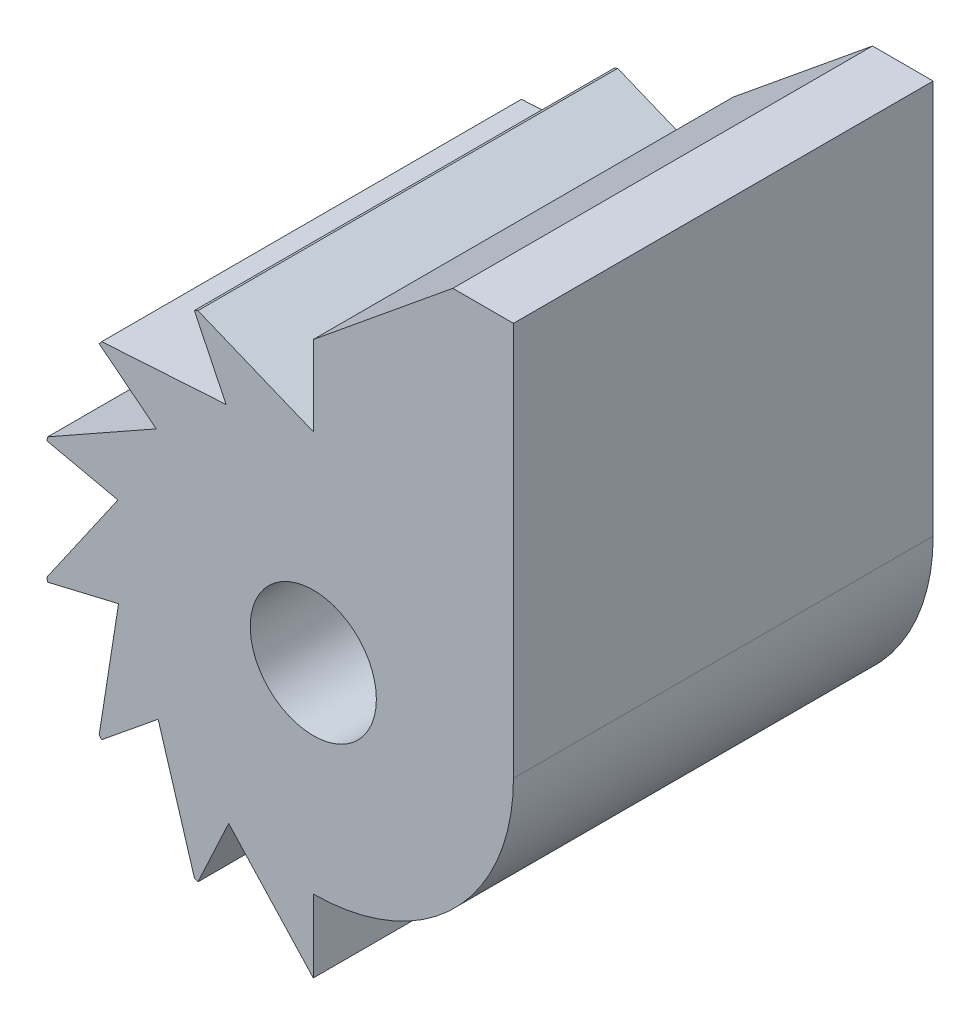
ISO-10303-21;
HEADER;
FILE_DESCRIPTION(('STEP AP214'),'2;1');
FILE_NAME('part.step','',(''),(''),'','','');
FILE_SCHEMA(('AUTOMOTIVE_DESIGN { 1 0 10303 214 1 1 1 1 }'));
ENDSEC;
DATA;
#1=APPLICATION_CONTEXT('core data for automotive mechanical design processes');
#2=APPLICATION_PROTOCOL_DEFINITION('international standard','automotive_design',2000,#1);
#3=PRODUCT_CONTEXT('',#1,'mechanical');
#4=PRODUCT('Part','Part','',(#3));
#5=PRODUCT_RELATED_PRODUCT_CATEGORY('part','',(#4));
#6=PRODUCT_DEFINITION_FORMATION('','',#4);
#7=PRODUCT_DEFINITION_CONTEXT('part definition',#1,'design');
#8=PRODUCT_DEFINITION('design','',#6,#7);
#9=PRODUCT_DEFINITION_SHAPE('','',#8);
#10=(LENGTH_UNIT() NAMED_UNIT(*) SI_UNIT(.MILLI.,.METRE.));
#11=(NAMED_UNIT(*) PLANE_ANGLE_UNIT() SI_UNIT($,.RADIAN.));
#12=(NAMED_UNIT(*) SI_UNIT($,.STERADIAN.) SOLID_ANGLE_UNIT());
#13=UNCERTAINTY_MEASURE_WITH_UNIT(LENGTH_MEASURE(1.E-05),#10,'distance_accuracy_value','');
#14=(GEOMETRIC_REPRESENTATION_CONTEXT(3) GLOBAL_UNCERTAINTY_ASSIGNED_CONTEXT((#13)) GLOBAL_UNIT_ASSIGNED_CONTEXT((#10,
#11,#12)) REPRESENTATION_CONTEXT('',''));
#15=CARTESIAN_POINT('',(0.,0.,0.));
#16=DIRECTION('',(0.,0.,1.));
#17=DIRECTION('',(1.,0.,0.));
#18=AXIS2_PLACEMENT_3D('',#15,#16,#17);
#19=CARTESIAN_POINT('',(0.,0.,21.971));
#20=DIRECTION('',(0.,0.,-1.));
#21=DIRECTION('',(-1.,0.,0.));
#22=AXIS2_PLACEMENT_3D('',#19,#20,#21);
#23=CYLINDRICAL_SURFACE('',#22,14.2875);
#24=DIRECTION('',(0.,0.,1.));
#25=VECTOR('',#24,1.);
#26=CARTESIAN_POINT('',(-6.2258468466904,12.8596845720086,0.));
#27=LINE('',#26,#25);
#28=CARTESIAN_POINT('',(-6.2258468466904,12.8596845720086,0.));
#29=VERTEX_POINT('',#28);
#30=CARTESIAN_POINT('',(-6.2258468466904,12.8596845720086,21.971));
#31=VERTEX_POINT('',#30);
#32=EDGE_CURVE('E269',#29,#31,#27,.T.);
#33=ORIENTED_EDGE('',*,*,#32,.T.);
#34=CARTESIAN_POINT('',(0.,0.,21.971));
#35=DIRECTION('',(0.,0.,1.));
#36=DIRECTION('',(1.,0.,0.));
#37=AXIS2_PLACEMENT_3D('',#34,#35,#36);
#38=CIRCLE('',#37,14.2875);
#39=CARTESIAN_POINT('',(-6.0381584146203,12.9488725072861,21.971));
#40=VERTEX_POINT('',#39);
#41=EDGE_CURVE('E233',#31,#40,#38,.F.);
#42=ORIENTED_EDGE('',*,*,#41,.T.);
#43=DIRECTION('',(0.,0.,1.));
#44=VECTOR('',#43,1.);
#45=CARTESIAN_POINT('',(-6.0381584146203,12.9488725072861,0.));
#46=LINE('',#45,#44);
#47=CARTESIAN_POINT('',(-6.0381584146203,12.9488725072861,0.));
#48=VERTEX_POINT('',#47);
#49=EDGE_CURVE('E216',#48,#40,#46,.T.);
#50=ORIENTED_EDGE('',*,*,#49,.F.);
#51=CARTESIAN_POINT('',(0.,0.,0.));
#52=DIRECTION('',(0.,0.,1.));
#53=DIRECTION('',(1.,0.,0.));
#54=AXIS2_PLACEMENT_3D('',#51,#52,#53);
#55=CIRCLE('',#54,14.2875);
#56=EDGE_CURVE('E292',#29,#48,#55,.F.);
#57=ORIENTED_EDGE('',*,*,#56,.F.);
#58=EDGE_LOOP('',(#33,#42,#50,#57));
#59=FACE_BOUND('',#58,.T.);
#60=ADVANCED_FACE('F39',(#59),#23,.T.);
#61=DIRECTION('',(0.,0.,1.));
#62=VECTOR('',#61,1.);
#63=CARTESIAN_POINT('',(-13.9023785884092,-3.29492425323272,0.));
#64=LINE('',#63,#62);
#65=CARTESIAN_POINT('',(-13.9023785884092,-3.29492425323272,0.));
#66=VERTEX_POINT('',#65);
#67=CARTESIAN_POINT('',(-13.9023785884092,-3.29492425323272,21.971));
#68=VERTEX_POINT('',#67);
#69=EDGE_CURVE('E464',#66,#68,#64,.T.);
#70=ORIENTED_EDGE('',*,*,#69,.T.);
#71=CARTESIAN_POINT('',(-13.948829201726,-3.09238098414067,21.971));
#72=VERTEX_POINT('',#71);
#73=EDGE_CURVE('E438',#68,#72,#38,.F.);
#74=ORIENTED_EDGE('',*,*,#73,.T.);
#75=DIRECTION('',(0.,0.,1.));
#76=VECTOR('',#75,1.);
#77=CARTESIAN_POINT('',(-13.948829201726,-3.09238098414067,0.));
#78=LINE('',#77,#76);
#79=CARTESIAN_POINT('',(-13.948829201726,-3.09238098414067,0.));
#80=VERTEX_POINT('',#79);
#81=EDGE_CURVE('E524',#80,#72,#78,.T.);
#82=ORIENTED_EDGE('',*,*,#81,.F.);
#83=EDGE_CURVE('E358',#66,#80,#55,.F.);
#84=ORIENTED_EDGE('',*,*,#83,.F.);
#85=EDGE_LOOP('',(#70,#74,#82,#84));
#86=FACE_BOUND('',#85,.T.);
#87=ADVANCED_FACE('F403',(#86),#23,.T.);
#88=DIRECTION('',(0.,0.,1.));
#89=VECTOR('',#88,1.);
#90=CARTESIAN_POINT('',(-11.2073388125384,-8.86161458149528,0.));
#91=LINE('',#90,#89);
#92=CARTESIAN_POINT('',(-11.2073388125384,-8.86161458149528,0.));
#93=VERTEX_POINT('',#92);
#94=CARTESIAN_POINT('',(-11.2073388125384,-8.86161458149528,21.971));
#95=VERTEX_POINT('',#94);
#96=EDGE_CURVE('E448',#93,#95,#91,.T.);
#97=ORIENTED_EDGE('',*,*,#96,.F.);
#98=CARTESIAN_POINT('',(-11.0772710184089,-9.02367569423451,0.));
#99=VERTEX_POINT('',#98);
#100=EDGE_CURVE('E356',#99,#93,#55,.F.);
#101=ORIENTED_EDGE('',*,*,#100,.F.);
#102=DIRECTION('',(0.,0.,1.));
#103=VECTOR('',#102,1.);
#104=CARTESIAN_POINT('',(-11.0772710184089,-9.02367569423451,0.));
#105=LINE('',#104,#103);
#106=CARTESIAN_POINT('',(-11.0772710184089,-9.02367569423451,21.971));
#107=VERTEX_POINT('',#106);
#108=EDGE_CURVE('E287',#99,#107,#105,.T.);
#109=ORIENTED_EDGE('',*,*,#108,.T.);
#110=EDGE_CURVE('E440',#107,#95,#38,.F.);
#111=ORIENTED_EDGE('',*,*,#110,.T.);
#112=EDGE_LOOP('',(#97,#101,#109,#111));
#113=FACE_BOUND('',#112,.T.);
#114=ADVANCED_FACE('F407',(#113),#23,.T.);
#115=DIRECTION('',(0.,0.,1.));
#116=VECTOR('',#115,1.);
#117=CARTESIAN_POINT('',(-13.9488292017261,3.09238098414053,0.));
#118=LINE('',#117,#116);
#119=CARTESIAN_POINT('',(-13.9488292017261,3.09238098414053,0.));
#120=VERTEX_POINT('',#119);
#121=CARTESIAN_POINT('',(-13.9488292017261,3.09238098414053,21.971));
#122=VERTEX_POINT('',#121);
#123=EDGE_CURVE('E425',#120,#122,#118,.T.);
#124=ORIENTED_EDGE('',*,*,#123,.T.);
#125=CARTESIAN_POINT('',(-13.9023785884092,3.29492425323258,21.971));
#126=VERTEX_POINT('',#125);
#127=EDGE_CURVE('E428',#122,#126,#38,.F.);
#128=ORIENTED_EDGE('',*,*,#127,.T.);
#129=DIRECTION('',(0.,0.,1.));
#130=VECTOR('',#129,1.);
#131=CARTESIAN_POINT('',(-13.9023785884092,3.29492425323258,0.));
#132=LINE('',#131,#130);
#133=CARTESIAN_POINT('',(-13.9023785884092,3.29492425323258,0.));
#134=VERTEX_POINT('',#133);
#135=EDGE_CURVE('E530',#134,#126,#132,.T.);
#136=ORIENTED_EDGE('',*,*,#135,.F.);
#137=EDGE_CURVE('E363',#120,#134,#55,.F.);
#138=ORIENTED_EDGE('',*,*,#137,.F.);
#139=EDGE_LOOP('',(#124,#128,#136,#138));
#140=FACE_BOUND('',#139,.T.);
#141=ADVANCED_FACE('F414',(#140),#23,.T.);
#142=DIRECTION('',(0.,0.,1.));
#143=VECTOR('',#142,1.);
#144=CARTESIAN_POINT('',(-11.077271018409,9.0236756942344,0.));
#145=LINE('',#144,#143);
#146=CARTESIAN_POINT('',(-11.077271018409,9.0236756942344,0.));
#147=VERTEX_POINT('',#146);
#148=CARTESIAN_POINT('',(-11.077271018409,9.0236756942344,21.971));
#149=VERTEX_POINT('',#148);
#150=EDGE_CURVE('E265',#147,#149,#145,.T.);
#151=ORIENTED_EDGE('',*,*,#150,.F.);
#152=CARTESIAN_POINT('',(-11.2073388125385,8.86161458149516,0.));
#153=VERTEX_POINT('',#152);
#154=EDGE_CURVE('E313',#153,#147,#55,.F.);
#155=ORIENTED_EDGE('',*,*,#154,.F.);
#156=DIRECTION('',(0.,0.,1.));
#157=VECTOR('',#156,1.);
#158=CARTESIAN_POINT('',(-11.2073388125385,8.86161458149516,0.));
#159=LINE('',#158,#157);
#160=CARTESIAN_POINT('',(-11.2073388125385,8.86161458149516,21.971));
#161=VERTEX_POINT('',#160);
#162=EDGE_CURVE('E380',#153,#161,#159,.T.);
#163=ORIENTED_EDGE('',*,*,#162,.T.);
#164=EDGE_CURVE('E296',#161,#149,#38,.F.);
#165=ORIENTED_EDGE('',*,*,#164,.T.);
#166=EDGE_LOOP('',(#151,#155,#163,#165));
#167=FACE_BOUND('',#166,.T.);
#168=ADVANCED_FACE('F378',(#167),#23,.T.);
#169=DIRECTION('',(0.,0.,1.));
#170=VECTOR('',#169,1.);
#171=CARTESIAN_POINT('',(-6.22584684669026,-12.8596845720086,0.));
#172=LINE('',#171,#170);
#173=CARTESIAN_POINT('',(-6.22584684669026,-12.8596845720086,0.));
#174=VERTEX_POINT('',#173);
#175=CARTESIAN_POINT('',(-6.22584684669026,-12.8596845720086,21.971));
#176=VERTEX_POINT('',#175);
#177=EDGE_CURVE('E354',#174,#176,#172,.T.);
#178=ORIENTED_EDGE('',*,*,#177,.F.);
#179=CARTESIAN_POINT('',(-6.03815841462016,-12.9488725072862,0.));
#180=VERTEX_POINT('',#179);
#181=EDGE_CURVE('E314',#180,#174,#55,.F.);
#182=ORIENTED_EDGE('',*,*,#181,.F.);
#183=DIRECTION('',(0.,0.,1.));
#184=VECTOR('',#183,1.);
#185=CARTESIAN_POINT('',(-6.03815841462016,-12.9488725072862,0.));
#186=LINE('',#185,#184);
#187=CARTESIAN_POINT('',(-6.03815841462016,-12.9488725072862,21.971));
#188=VERTEX_POINT('',#187);
#189=EDGE_CURVE('E289',#180,#188,#186,.T.);
#190=ORIENTED_EDGE('',*,*,#189,.T.);
#191=EDGE_CURVE('E297',#188,#176,#38,.F.);
#192=ORIENTED_EDGE('',*,*,#191,.T.);
#193=EDGE_LOOP('',(#178,#182,#190,#192));
#194=FACE_BOUND('',#193,.T.);
#195=ADVANCED_FACE('F41',(#194),#23,.T.);
#196=CARTESIAN_POINT('',(0.,0.,21.971));
#197=DIRECTION('',(1.,0.,0.));
#198=DIRECTION('',(0.,1.,0.));
#199=AXIS2_PLACEMENT_3D('',#196,#197,#198);
#200=PLANE('',#199);
#201=DIRECTION('',(0.,-1.,0.));
#202=VECTOR('',#201,1.);
#203=CARTESIAN_POINT('',(0.,0.,0.));
#204=LINE('',#203,#202);
#205=CARTESIAN_POINT('',(0.,-10.4775,0.));
#206=VERTEX_POINT('',#205);
#207=CARTESIAN_POINT('',(0.,-14.2875,0.));
#208=VERTEX_POINT('',#207);
#209=EDGE_CURVE('E315',#206,#208,#204,.T.);
#210=ORIENTED_EDGE('',*,*,#209,.F.);
#211=DIRECTION('',(0.,0.,-1.));
#212=VECTOR('',#211,1.);
#213=CARTESIAN_POINT('',(0.,-10.4775,21.971));
#214=LINE('',#213,#212);
#215=CARTESIAN_POINT('',(0.,-10.4775,21.971));
#216=VERTEX_POINT('',#215);
#217=EDGE_CURVE('E48',#216,#206,#214,.T.);
#218=ORIENTED_EDGE('',*,*,#217,.F.);
#219=DIRECTION('',(0.,-1.,0.));
#220=VECTOR('',#219,1.);
#221=CARTESIAN_POINT('',(0.,0.,21.971));
#222=LINE('',#221,#220);
#223=CARTESIAN_POINT('',(0.,-14.2875,21.971));
#224=VERTEX_POINT('',#223);
#225=EDGE_CURVE('E298',#216,#224,#222,.T.);
#226=ORIENTED_EDGE('',*,*,#225,.T.);
#227=DIRECTION('',(0.,0.,-1.));
#228=VECTOR('',#227,1.);
#229=CARTESIAN_POINT('',(0.,-14.2875,21.971));
#230=LINE('',#229,#228);
#231=EDGE_CURVE('E11',#224,#208,#230,.T.);
#232=ORIENTED_EDGE('',*,*,#231,.T.);
#233=EDGE_LOOP('',(#210,#218,#226,#232));
#234=FACE_BOUND('',#233,.T.);
#235=ADVANCED_FACE('F340',(#234),#200,.T.);
#236=CARTESIAN_POINT('',(0.,0.,21.971));
#237=DIRECTION('',(0.,0.,-1.));
#238=DIRECTION('',(-1.,0.,0.));
#239=AXIS2_PLACEMENT_3D('',#236,#237,#238);
#240=CYLINDRICAL_SURFACE('',#239,10.4775);
#241=CARTESIAN_POINT('',(0.,0.,0.));
#242=DIRECTION('',(0.,0.,1.));
#243=DIRECTION('',(1.,0.,0.));
#244=AXIS2_PLACEMENT_3D('',#241,#242,#243);
#245=CIRCLE('',#244,10.4775);
#246=CARTESIAN_POINT('',(10.4775,0.,0.));
#247=VERTEX_POINT('',#246);
#248=EDGE_CURVE('E318',#206,#247,#245,.T.);
#249=ORIENTED_EDGE('',*,*,#248,.T.);
#250=DIRECTION('',(0.,0.,-1.));
#251=VECTOR('',#250,1.);
#252=CARTESIAN_POINT('',(10.4775,0.,21.971));
#253=LINE('',#252,#251);
#254=CARTESIAN_POINT('',(10.4775,0.,21.971));
#255=VERTEX_POINT('',#254);
#256=EDGE_CURVE('E243',#255,#247,#253,.T.);
#257=ORIENTED_EDGE('',*,*,#256,.F.);
#258=CARTESIAN_POINT('',(0.,0.,21.971));
#259=DIRECTION('',(0.,0.,1.));
#260=DIRECTION('',(1.,0.,0.));
#261=AXIS2_PLACEMENT_3D('',#258,#259,#260);
#262=CIRCLE('',#261,10.4775);
#263=EDGE_CURVE('E301',#216,#255,#262,.T.);
#264=ORIENTED_EDGE('',*,*,#263,.F.);
#265=ORIENTED_EDGE('',*,*,#217,.T.);
#266=EDGE_LOOP('',(#249,#257,#264,#265));
#267=FACE_BOUND('',#266,.T.);
#268=ADVANCED_FACE('F337',(#267),#240,.T.);
#269=CARTESIAN_POINT('',(10.4775,0.,21.971));
#270=DIRECTION('',(-1.,0.,0.));
#271=DIRECTION('',(0.,0.,1.));
#272=AXIS2_PLACEMENT_3D('',#269,#270,#271);
#273=PLANE('',#272);
#274=DIRECTION('',(0.,1.,0.));
#275=VECTOR('',#274,1.);
#276=CARTESIAN_POINT('',(10.4775,0.,0.));
#277=LINE('',#276,#275);
#278=CARTESIAN_POINT('',(10.4775,20.6299721885842,0.));
#279=VERTEX_POINT('',#278);
#280=EDGE_CURVE('E235',#247,#279,#277,.T.);
#281=ORIENTED_EDGE('',*,*,#280,.T.);
#282=DIRECTION('',(0.,0.,-1.));
#283=VECTOR('',#282,1.);
#284=CARTESIAN_POINT('',(10.4775,20.6299721885842,21.971));
#285=LINE('',#284,#283);
#286=CARTESIAN_POINT('',(10.4775,20.6299721885842,21.971));
#287=VERTEX_POINT('',#286);
#288=EDGE_CURVE('E240',#287,#279,#285,.T.);
#289=ORIENTED_EDGE('',*,*,#288,.F.);
#290=DIRECTION('',(0.,1.,0.));
#291=VECTOR('',#290,1.);
#292=CARTESIAN_POINT('',(10.4775,0.,21.971));
#293=LINE('',#292,#291);
#294=EDGE_CURVE('E303',#255,#287,#293,.T.);
#295=ORIENTED_EDGE('',*,*,#294,.F.);
#296=ORIENTED_EDGE('',*,*,#256,.T.);
#297=EDGE_LOOP('',(#281,#289,#295,#296));
#298=FACE_BOUND('',#297,.T.);
#299=ADVANCED_FACE('F323',(#298),#273,.F.);
#300=CARTESIAN_POINT('',(0.,20.6299721885842,21.971));
#301=DIRECTION('',(0.,1.,0.));
#302=DIRECTION('',(0.,0.,1.));
#303=AXIS2_PLACEMENT_3D('',#300,#301,#302);
#304=PLANE('',#303);
#305=DIRECTION('',(1.,0.,0.));
#306=VECTOR('',#305,1.);
#307=CARTESIAN_POINT('',(0.,20.6299721885842,0.));
#308=LINE('',#307,#306);
#309=CARTESIAN_POINT('',(7.3025,20.6299721885842,0.));
#310=VERTEX_POINT('',#309);
#311=EDGE_CURVE('E230',#310,#279,#308,.T.);
#312=ORIENTED_EDGE('',*,*,#311,.F.);
#313=DIRECTION('',(0.,0.,-1.));
#314=VECTOR('',#313,1.);
#315=CARTESIAN_POINT('',(7.3025,20.6299721885842,21.971));
#316=LINE('',#315,#314);
#317=CARTESIAN_POINT('',(7.3025,20.6299721885842,21.971));
#318=VERTEX_POINT('',#317);
#319=EDGE_CURVE('E228',#318,#310,#316,.T.);
#320=ORIENTED_EDGE('',*,*,#319,.F.);
#321=DIRECTION('',(1.,0.,0.));
#322=VECTOR('',#321,1.);
#323=CARTESIAN_POINT('',(0.,20.6299721885842,21.971));
#324=LINE('',#323,#322);
#325=EDGE_CURVE('E305',#318,#287,#324,.T.);
#326=ORIENTED_EDGE('',*,*,#325,.T.);
#327=ORIENTED_EDGE('',*,*,#288,.T.);
#328=EDGE_LOOP('',(#312,#320,#326,#327));
#329=FACE_BOUND('',#328,.T.);
#330=ADVANCED_FACE('F328',(#329),#304,.T.);
#331=CARTESIAN_POINT('',(-7.18349039885654,8.78561851999056,21.971));
#332=DIRECTION('',(0.632987411051358,-0.774162087324417,0.));
#333=DIRECTION('',(0.774162087324417,0.632987411051359,0.));
#334=AXIS2_PLACEMENT_3D('',#331,#332,#333);
#335=PLANE('',#334);
#336=DIRECTION('',(-0.774162087324417,-0.632987411051359,0.));
#337=VECTOR('',#336,1.);
#338=CARTESIAN_POINT('',(-7.18349039885654,8.78561851999056,0.));
#339=LINE('',#338,#337);
#340=CARTESIAN_POINT('',(0.,14.6591417321639,0.));
#341=VERTEX_POINT('',#340);
#342=EDGE_CURVE('E212',#310,#341,#339,.T.);
#343=ORIENTED_EDGE('',*,*,#342,.T.);
#344=DIRECTION('',(0.,0.,1.));
#345=VECTOR('',#344,1.);
#346=CARTESIAN_POINT('',(0.,14.6591417321639,0.));
#347=LINE('',#346,#345);
#348=CARTESIAN_POINT('',(0.,14.6591417321639,21.971));
#349=VERTEX_POINT('',#348);
#350=EDGE_CURVE('E218',#341,#349,#347,.T.);
#351=ORIENTED_EDGE('',*,*,#350,.T.);
#352=DIRECTION('',(-0.774162087324417,-0.632987411051359,0.));
#353=VECTOR('',#352,1.);
#354=CARTESIAN_POINT('',(-7.18349039885654,8.78561851999056,21.971));
#355=LINE('',#354,#353);
#356=EDGE_CURVE('E308',#318,#349,#355,.T.);
#357=ORIENTED_EDGE('',*,*,#356,.F.);
#358=ORIENTED_EDGE('',*,*,#319,.T.);
#359=EDGE_LOOP('',(#343,#351,#357,#358));
#360=FACE_BOUND('',#359,.T.);
#361=ADVANCED_FACE('F227',(#360),#335,.F.);
#362=CARTESIAN_POINT('',(0.,0.,21.971));
#363=DIRECTION('',(0.,0.,-1.));
#364=DIRECTION('',(-1.,0.,0.));
#365=AXIS2_PLACEMENT_3D('',#362,#363,#364);
#366=CYLINDRICAL_SURFACE('',#365,3.302);
#367=CARTESIAN_POINT('',(0.,0.,21.971));
#368=DIRECTION('',(0.,0.,1.));
#369=DIRECTION('',(1.,0.,0.));
#370=AXIS2_PLACEMENT_3D('',#367,#368,#369);
#371=CIRCLE('',#370,3.302);
#372=CARTESIAN_POINT('',(3.302,0.,21.971));
#373=VERTEX_POINT('',#372);
#374=EDGE_CURVE('E241',#373,#373,#371,.T.);
#375=ORIENTED_EDGE('',*,*,#374,.T.);
#376=EDGE_LOOP('',(#375));
#377=FACE_BOUND('',#376,.T.);
#378=CARTESIAN_POINT('',(0.,0.,0.));
#379=DIRECTION('',(0.,0.,1.));
#380=DIRECTION('',(1.,0.,0.));
#381=AXIS2_PLACEMENT_3D('',#378,#379,#380);
#382=CIRCLE('',#381,3.302);
#383=CARTESIAN_POINT('',(3.302,0.,0.));
#384=VERTEX_POINT('',#383);
#385=EDGE_CURVE('E229',#384,#384,#382,.T.);
#386=ORIENTED_EDGE('',*,*,#385,.F.);
#387=EDGE_LOOP('',(#386));
#388=FACE_BOUND('',#387,.T.);
#389=ADVANCED_FACE('F594',(#377,#388),#366,.F.);
#390=CARTESIAN_POINT('',(0.,0.,21.971));
#391=DIRECTION('',(0.,0.,1.));
#392=DIRECTION('',(1.,0.,0.));
#393=AXIS2_PLACEMENT_3D('',#390,#391,#392);
#394=PLANE('',#393);
#395=ORIENTED_EDGE('',*,*,#356,.T.);
#396=DIRECTION('',(0.,1.,0.));
#397=VECTOR('',#396,1.);
#398=CARTESIAN_POINT('',(-1.09721259855533E-13,10.4775,21.971));
#399=LINE('',#398,#397);
#400=CARTESIAN_POINT('',(-1.09721259855533E-13,10.4775,21.971));
#401=VERTEX_POINT('',#400);
#402=EDGE_CURVE('E221',#401,#349,#399,.T.);
#403=ORIENTED_EDGE('',*,*,#402,.F.);
#404=DIRECTION('',(0.925481584764661,-0.378792603229644,0.));
#405=VECTOR('',#404,1.);
#406=CARTESIAN_POINT('',(-6.0381584146203,12.9488725072861,21.971));
#407=LINE('',#406,#405);
#408=EDGE_CURVE('E225',#40,#401,#407,.T.);
#409=ORIENTED_EDGE('',*,*,#408,.F.);
#410=ORIENTED_EDGE('',*,*,#41,.F.);
#411=DIRECTION('',(-0.435754809917088,0.900065411864117,0.));
#412=VECTOR('',#411,1.);
#413=CARTESIAN_POINT('',(-4.56562102090629,9.43043535280629,21.971));
#414=LINE('',#413,#412);
#415=CARTESIAN_POINT('',(-4.56562102090629,9.43043535280629,21.971));
#416=VERTEX_POINT('',#415);
#417=EDGE_CURVE('E263',#416,#31,#414,.T.);
#418=ORIENTED_EDGE('',*,*,#417,.F.);
#419=DIRECTION('',(0.998054662582194,0.062344931613909,0.));
#420=VECTOR('',#419,1.);
#421=CARTESIAN_POINT('',(-11.077271018409,9.0236756942344,21.971));
#422=LINE('',#421,#420);
#423=EDGE_CURVE('E258',#149,#416,#422,.T.);
#424=ORIENTED_EDGE('',*,*,#423,.F.);
#425=ORIENTED_EDGE('',*,*,#164,.F.);
#426=DIRECTION('',(-0.784415664919582,0.620235491268253,0.));
#427=VECTOR('',#426,1.);
#428=CARTESIAN_POINT('',(-8.21871512919492,6.49851735976312,21.971));
#429=LINE('',#428,#427);
#430=CARTESIAN_POINT('',(-8.21871512919492,6.49851735976312,21.971));
#431=VERTEX_POINT('',#430);
#432=EDGE_CURVE('E528',#431,#161,#429,.T.);
#433=ORIENTED_EDGE('',*,*,#432,.F.);
#434=DIRECTION('',(0.871147377115237,0.491021636331072,0.));
#435=VECTOR('',#434,1.);
#436=CARTESIAN_POINT('',(-13.9023785884092,3.29492425323258,21.971));
#437=LINE('',#436,#435);
#438=EDGE_CURVE('E272',#126,#431,#437,.T.);
#439=ORIENTED_EDGE('',*,*,#438,.F.);
#440=ORIENTED_EDGE('',*,*,#127,.F.);
#441=DIRECTION('',(-0.976296007119935,0.216439613938095,0.));
#442=VECTOR('',#441,1.);
#443=CARTESIAN_POINT('',(-10.2291414145991,2.26774605503639,21.971));
#444=LINE('',#443,#442);
#445=CARTESIAN_POINT('',(-10.2291414145991,2.26774605503639,21.971));
#446=VERTEX_POINT('',#445);
#447=EDGE_CURVE('E436',#446,#122,#444,.T.);
#448=ORIENTED_EDGE('',*,*,#447,.F.);
#449=DIRECTION('',(0.570124582972956,0.821558251063133,0.));
#450=VECTOR('',#449,1.);
#451=CARTESIAN_POINT('',(-13.948829201726,-3.09238098414067,21.971));
#452=LINE('',#451,#450);
#453=EDGE_CURVE('E516',#72,#446,#452,.T.);
#454=ORIENTED_EDGE('',*,*,#453,.F.);
#455=ORIENTED_EDGE('',*,*,#73,.F.);
#456=DIRECTION('',(-0.973044870579822,-0.230615870742448,0.));
#457=VECTOR('',#456,1.);
#458=CARTESIAN_POINT('',(-10.1950776315001,-2.416277785704,21.971));
#459=LINE('',#458,#457);
#460=CARTESIAN_POINT('',(-10.1950776315001,-2.416277785704,21.971));
#461=VERTEX_POINT('',#460);
#462=EDGE_CURVE('E454',#461,#68,#459,.T.);
#463=ORIENTED_EDGE('',*,*,#462,.F.);
#464=DIRECTION('',(0.155151458059591,0.98789069489594,0.));
#465=VECTOR('',#464,1.);
#466=CARTESIAN_POINT('',(-11.2073388125384,-8.86161458149528,21.971));
#467=LINE('',#466,#465);
#468=EDGE_CURVE('E430',#95,#461,#467,.T.);
#469=ORIENTED_EDGE('',*,*,#468,.F.);
#470=ORIENTED_EDGE('',*,*,#110,.F.);
#471=DIRECTION('',(-0.775312057281461,-0.631578351302503,0.));
#472=VECTOR('',#471,1.);
#473=CARTESIAN_POINT('',(-8.12333208016651,-6.61736217577198,21.971));
#474=LINE('',#473,#472);
#475=CARTESIAN_POINT('',(-8.12333208016651,-6.61736217577198,21.971));
#476=VERTEX_POINT('',#475);
#477=EDGE_CURVE('E451',#476,#107,#474,.T.);
#478=ORIENTED_EDGE('',*,*,#477,.F.);
#479=DIRECTION('',(-0.290831660973507,0.956774239293362,0.));
#480=VECTOR('',#479,1.);
#481=CARTESIAN_POINT('',(-6.22584684669026,-12.8596845720086,21.971));
#482=LINE('',#481,#480);
#483=EDGE_CURVE('E466',#176,#476,#482,.T.);
#484=ORIENTED_EDGE('',*,*,#483,.F.);
#485=ORIENTED_EDGE('',*,*,#191,.F.);
#486=DIRECTION('',(-0.422618261740694,-0.906307787036653,0.));
#487=VECTOR('',#486,1.);
#488=CARTESIAN_POINT('',(-4.42798283738812,-9.49583983867653,21.971));
#489=LINE('',#488,#487);
#490=CARTESIAN_POINT('',(-4.42798283738812,-9.49583983867653,21.971));
#491=VERTEX_POINT('',#490);
#492=EDGE_CURVE('E280',#491,#188,#489,.T.);
#493=ORIENTED_EDGE('',*,*,#492,.F.);
#494=DIRECTION('',(-0.678686495494082,0.734428104605183,0.));
#495=VECTOR('',#494,1.);
#496=CARTESIAN_POINT('',(0.,-14.2875,21.971));
#497=LINE('',#496,#495);
#498=EDGE_CURVE('E284',#224,#491,#497,.T.);
#499=ORIENTED_EDGE('',*,*,#498,.F.);
#500=ORIENTED_EDGE('',*,*,#225,.F.);
#501=ORIENTED_EDGE('',*,*,#263,.T.);
#502=ORIENTED_EDGE('',*,*,#294,.T.);
#503=ORIENTED_EDGE('',*,*,#325,.F.);
#504=EDGE_LOOP('',(#395,#403,#409,#410,#418,#424,#425,#433,#439,#440,#448,#454,#455,#463,#469,
#470,#478,#484,#485,#493,#499,#500,#501,#502,#503));
#505=FACE_BOUND('',#504,.T.);
#506=ORIENTED_EDGE('',*,*,#374,.F.);
#507=EDGE_LOOP('',(#506));
#508=FACE_BOUND('',#507,.T.);
#509=ADVANCED_FACE('F331',(#505,#508),#394,.T.);
#510=CARTESIAN_POINT('',(0.,0.,0.));
#511=DIRECTION('',(0.,0.,1.));
#512=DIRECTION('',(1.,0.,0.));
#513=AXIS2_PLACEMENT_3D('',#510,#511,#512);
#514=PLANE('',#513);
#515=DIRECTION('',(0.,1.,0.));
#516=VECTOR('',#515,1.);
#517=CARTESIAN_POINT('',(-1.09721259855533E-13,10.4775,0.));
#518=LINE('',#517,#516);
#519=CARTESIAN_POINT('',(-1.09721259855533E-13,10.4775,0.));
#520=VERTEX_POINT('',#519);
#521=EDGE_CURVE('E64',#520,#341,#518,.T.);
#522=ORIENTED_EDGE('',*,*,#521,.T.);
#523=ORIENTED_EDGE('',*,*,#342,.F.);
#524=ORIENTED_EDGE('',*,*,#311,.T.);
#525=ORIENTED_EDGE('',*,*,#280,.F.);
#526=ORIENTED_EDGE('',*,*,#248,.F.);
#527=ORIENTED_EDGE('',*,*,#209,.T.);
#528=DIRECTION('',(-0.678686495494082,0.734428104605183,0.));
#529=VECTOR('',#528,1.);
#530=CARTESIAN_POINT('',(0.,-14.2875,0.));
#531=LINE('',#530,#529);
#532=CARTESIAN_POINT('',(-4.42798283738812,-9.49583983867653,0.));
#533=VERTEX_POINT('',#532);
#534=EDGE_CURVE('E276',#208,#533,#531,.T.);
#535=ORIENTED_EDGE('',*,*,#534,.T.);
#536=DIRECTION('',(-0.422618261740694,-0.906307787036653,0.));
#537=VECTOR('',#536,1.);
#538=CARTESIAN_POINT('',(-4.42798283738812,-9.49583983867653,0.));
#539=LINE('',#538,#537);
#540=EDGE_CURVE('E279',#533,#180,#539,.T.);
#541=ORIENTED_EDGE('',*,*,#540,.T.);
#542=ORIENTED_EDGE('',*,*,#181,.T.);
#543=DIRECTION('',(-0.290831660973507,0.956774239293362,0.));
#544=VECTOR('',#543,1.);
#545=CARTESIAN_POINT('',(-6.22584684669026,-12.8596845720086,0.));
#546=LINE('',#545,#544);
#547=CARTESIAN_POINT('',(-8.12333208016651,-6.61736217577198,0.));
#548=VERTEX_POINT('',#547);
#549=EDGE_CURVE('E470',#174,#548,#546,.T.);
#550=ORIENTED_EDGE('',*,*,#549,.T.);
#551=DIRECTION('',(-0.775312057281461,-0.631578351302503,0.));
#552=VECTOR('',#551,1.);
#553=CARTESIAN_POINT('',(-8.12333208016651,-6.61736217577198,0.));
#554=LINE('',#553,#552);
#555=EDGE_CURVE('E472',#548,#99,#554,.T.);
#556=ORIENTED_EDGE('',*,*,#555,.T.);
#557=ORIENTED_EDGE('',*,*,#100,.T.);
#558=DIRECTION('',(0.155151458059591,0.98789069489594,0.));
#559=VECTOR('',#558,1.);
#560=CARTESIAN_POINT('',(-11.2073388125384,-8.86161458149528,0.));
#561=LINE('',#560,#559);
#562=CARTESIAN_POINT('',(-10.1950776315001,-2.416277785704,0.));
#563=VERTEX_POINT('',#562);
#564=EDGE_CURVE('E458',#93,#563,#561,.T.);
#565=ORIENTED_EDGE('',*,*,#564,.T.);
#566=DIRECTION('',(-0.973044870579822,-0.230615870742448,0.));
#567=VECTOR('',#566,1.);
#568=CARTESIAN_POINT('',(-10.1950776315001,-2.416277785704,0.));
#569=LINE('',#568,#567);
#570=EDGE_CURVE('E461',#563,#66,#569,.T.);
#571=ORIENTED_EDGE('',*,*,#570,.T.);
#572=ORIENTED_EDGE('',*,*,#83,.T.);
#573=DIRECTION('',(0.570124582972956,0.821558251063133,0.));
#574=VECTOR('',#573,1.);
#575=CARTESIAN_POINT('',(-13.948829201726,-3.09238098414067,0.));
#576=LINE('',#575,#574);
#577=CARTESIAN_POINT('',(-10.2291414145991,2.26774605503639,0.));
#578=VERTEX_POINT('',#577);
#579=EDGE_CURVE('E515',#80,#578,#576,.T.);
#580=ORIENTED_EDGE('',*,*,#579,.T.);
#581=DIRECTION('',(-0.976296007119935,0.216439613938095,0.));
#582=VECTOR('',#581,1.);
#583=CARTESIAN_POINT('',(-10.2291414145991,2.26774605503639,0.));
#584=LINE('',#583,#582);
#585=EDGE_CURVE('E518',#578,#120,#584,.T.);
#586=ORIENTED_EDGE('',*,*,#585,.T.);
#587=ORIENTED_EDGE('',*,*,#137,.T.);
#588=DIRECTION('',(0.871147377115237,0.491021636331072,0.));
#589=VECTOR('',#588,1.);
#590=CARTESIAN_POINT('',(-13.9023785884092,3.29492425323258,0.));
#591=LINE('',#590,#589);
#592=CARTESIAN_POINT('',(-8.21871512919492,6.49851735976312,0.));
#593=VERTEX_POINT('',#592);
#594=EDGE_CURVE('E526',#134,#593,#591,.T.);
#595=ORIENTED_EDGE('',*,*,#594,.T.);
#596=DIRECTION('',(-0.784415664919582,0.620235491268253,0.));
#597=VECTOR('',#596,1.);
#598=CARTESIAN_POINT('',(-8.21871512919492,6.49851735976312,0.));
#599=LINE('',#598,#597);
#600=EDGE_CURVE('E374',#593,#153,#599,.T.);
#601=ORIENTED_EDGE('',*,*,#600,.T.);
#602=ORIENTED_EDGE('',*,*,#154,.T.);
#603=DIRECTION('',(0.998054662582194,0.062344931613909,0.));
#604=VECTOR('',#603,1.);
#605=CARTESIAN_POINT('',(-11.077271018409,9.0236756942344,0.));
#606=LINE('',#605,#604);
#607=CARTESIAN_POINT('',(-4.56562102090629,9.43043535280629,0.));
#608=VERTEX_POINT('',#607);
#609=EDGE_CURVE('E260',#147,#608,#606,.T.);
#610=ORIENTED_EDGE('',*,*,#609,.T.);
#611=DIRECTION('',(-0.435754809917088,0.900065411864117,0.));
#612=VECTOR('',#611,1.);
#613=CARTESIAN_POINT('',(-4.56562102090629,9.43043535280629,0.));
#614=LINE('',#613,#612);
#615=EDGE_CURVE('E56',#608,#29,#614,.T.);
#616=ORIENTED_EDGE('',*,*,#615,.T.);
#617=ORIENTED_EDGE('',*,*,#56,.T.);
#618=DIRECTION('',(0.925481584764661,-0.378792603229644,0.));
#619=VECTOR('',#618,1.);
#620=CARTESIAN_POINT('',(-6.0381584146203,12.9488725072861,0.));
#621=LINE('',#620,#619);
#622=EDGE_CURVE('E215',#48,#520,#621,.T.);
#623=ORIENTED_EDGE('',*,*,#622,.T.);
#624=EDGE_LOOP('',(#522,#523,#524,#525,#526,#527,#535,#541,#542,#550,#556,#557,#565,#571,#572,
#580,#586,#587,#595,#601,#602,#610,#616,#617,#623));
#625=FACE_BOUND('',#624,.T.);
#626=ORIENTED_EDGE('',*,*,#385,.T.);
#627=EDGE_LOOP('',(#626));
#628=FACE_BOUND('',#627,.T.);
#629=ADVANCED_FACE('F208',(#625,#628),#514,.F.);
#630=CARTESIAN_POINT('',(-4.42798283738812,-9.49583983867653,0.));
#631=DIRECTION('',(-0.906307787036653,0.422618261740694,0.));
#632=DIRECTION('',(-0.422618261740694,-0.906307787036653,0.));
#633=AXIS2_PLACEMENT_3D('',#630,#631,#632);
#634=PLANE('',#633);
#635=ORIENTED_EDGE('',*,*,#492,.T.);
#636=ORIENTED_EDGE('',*,*,#189,.F.);
#637=ORIENTED_EDGE('',*,*,#540,.F.);
#638=DIRECTION('',(0.,0.,1.));
#639=VECTOR('',#638,1.);
#640=CARTESIAN_POINT('',(-4.42798283738812,-9.49583983867653,0.));
#641=LINE('',#640,#639);
#642=EDGE_CURVE('E283',#533,#491,#641,.T.);
#643=ORIENTED_EDGE('',*,*,#642,.T.);
#644=EDGE_LOOP('',(#635,#636,#637,#643));
#645=FACE_BOUND('',#644,.T.);
#646=ADVANCED_FACE('F349',(#645),#634,.F.);
#647=CARTESIAN_POINT('',(0.,-14.2875,0.));
#648=DIRECTION('',(0.734428104605183,0.678686495494082,0.));
#649=DIRECTION('',(-0.678686495494082,0.734428104605183,0.));
#650=AXIS2_PLACEMENT_3D('',#647,#648,#649);
#651=PLANE('',#650);
#652=ORIENTED_EDGE('',*,*,#498,.T.);
#653=ORIENTED_EDGE('',*,*,#642,.F.);
#654=ORIENTED_EDGE('',*,*,#534,.F.);
#655=ORIENTED_EDGE('',*,*,#231,.F.);
#656=EDGE_LOOP('',(#652,#653,#654,#655));
#657=FACE_BOUND('',#656,.T.);
#658=ADVANCED_FACE('F342',(#657),#651,.F.);
#659=CARTESIAN_POINT('',(-8.21871512919492,6.49851735976312,0.));
#660=DIRECTION('',(0.620235491268253,0.784415664919582,0.));
#661=DIRECTION('',(-0.784415664919582,0.620235491268253,0.));
#662=AXIS2_PLACEMENT_3D('',#659,#660,#661);
#663=PLANE('',#662);
#664=ORIENTED_EDGE('',*,*,#432,.T.);
#665=ORIENTED_EDGE('',*,*,#162,.F.);
#666=ORIENTED_EDGE('',*,*,#600,.F.);
#667=DIRECTION('',(0.,0.,1.));
#668=VECTOR('',#667,1.);
#669=CARTESIAN_POINT('',(-8.21871512919492,6.49851735976312,0.));
#670=LINE('',#669,#668);
#671=EDGE_CURVE('E534',#593,#431,#670,.T.);
#672=ORIENTED_EDGE('',*,*,#671,.T.);
#673=EDGE_LOOP('',(#664,#665,#666,#672));
#674=FACE_BOUND('',#673,.T.);
#675=ADVANCED_FACE('F505',(#674),#663,.F.);
#676=CARTESIAN_POINT('',(-13.9023785884092,3.29492425323258,0.));
#677=DIRECTION('',(0.491021636331071,-0.871147377115237,0.));
#678=DIRECTION('',(0.871147377115237,0.491021636331072,0.));
#679=AXIS2_PLACEMENT_3D('',#676,#677,#678);
#680=PLANE('',#679);
#681=ORIENTED_EDGE('',*,*,#438,.T.);
#682=ORIENTED_EDGE('',*,*,#671,.F.);
#683=ORIENTED_EDGE('',*,*,#594,.F.);
#684=ORIENTED_EDGE('',*,*,#135,.T.);
#685=EDGE_LOOP('',(#681,#682,#683,#684));
#686=FACE_BOUND('',#685,.T.);
#687=ADVANCED_FACE('F502',(#686),#680,.F.);
#688=CARTESIAN_POINT('',(-10.2291414145991,2.26774605503639,0.));
#689=DIRECTION('',(0.216439613938095,0.976296007119935,0.));
#690=DIRECTION('',(-0.976296007119935,0.216439613938095,0.));
#691=AXIS2_PLACEMENT_3D('',#688,#689,#690);
#692=PLANE('',#691);
#693=ORIENTED_EDGE('',*,*,#447,.T.);
#694=ORIENTED_EDGE('',*,*,#123,.F.);
#695=ORIENTED_EDGE('',*,*,#585,.F.);
#696=DIRECTION('',(0.,0.,1.));
#697=VECTOR('',#696,1.);
#698=CARTESIAN_POINT('',(-10.2291414145991,2.26774605503639,0.));
#699=LINE('',#698,#697);
#700=EDGE_CURVE('E431',#578,#446,#699,.T.);
#701=ORIENTED_EDGE('',*,*,#700,.T.);
#702=EDGE_LOOP('',(#693,#694,#695,#701));
#703=FACE_BOUND('',#702,.T.);
#704=ADVANCED_FACE('F493',(#703),#692,.F.);
#705=CARTESIAN_POINT('',(-13.948829201726,-3.09238098414067,0.));
#706=DIRECTION('',(0.821558251063133,-0.570124582972956,0.));
#707=DIRECTION('',(0.570124582972956,0.821558251063133,0.));
#708=AXIS2_PLACEMENT_3D('',#705,#706,#707);
#709=PLANE('',#708);
#710=ORIENTED_EDGE('',*,*,#453,.T.);
#711=ORIENTED_EDGE('',*,*,#700,.F.);
#712=ORIENTED_EDGE('',*,*,#579,.F.);
#713=ORIENTED_EDGE('',*,*,#81,.T.);
#714=EDGE_LOOP('',(#710,#711,#712,#713));
#715=FACE_BOUND('',#714,.T.);
#716=ADVANCED_FACE('F485',(#715),#709,.F.);
#717=CARTESIAN_POINT('',(-8.12333208016651,-6.61736217577198,0.));
#718=DIRECTION('',(-0.631578351302503,0.775312057281461,0.));
#719=DIRECTION('',(-0.775312057281462,-0.631578351302503,0.));
#720=AXIS2_PLACEMENT_3D('',#717,#718,#719);
#721=PLANE('',#720);
#722=ORIENTED_EDGE('',*,*,#477,.T.);
#723=ORIENTED_EDGE('',*,*,#108,.F.);
#724=ORIENTED_EDGE('',*,*,#555,.F.);
#725=DIRECTION('',(0.,0.,1.));
#726=VECTOR('',#725,1.);
#727=CARTESIAN_POINT('',(-8.12333208016651,-6.61736217577198,0.));
#728=LINE('',#727,#726);
#729=EDGE_CURVE('E478',#548,#476,#728,.T.);
#730=ORIENTED_EDGE('',*,*,#729,.T.);
#731=EDGE_LOOP('',(#722,#723,#724,#730));
#732=FACE_BOUND('',#731,.T.);
#733=ADVANCED_FACE('F483',(#732),#721,.F.);
#734=CARTESIAN_POINT('',(-6.22584684669026,-12.8596845720086,0.));
#735=DIRECTION('',(0.956774239293362,0.290831660973506,0.));
#736=DIRECTION('',(-0.290831660973506,0.956774239293362,0.));
#737=AXIS2_PLACEMENT_3D('',#734,#735,#736);
#738=PLANE('',#737);
#739=ORIENTED_EDGE('',*,*,#483,.T.);
#740=ORIENTED_EDGE('',*,*,#729,.F.);
#741=ORIENTED_EDGE('',*,*,#549,.F.);
#742=ORIENTED_EDGE('',*,*,#177,.T.);
#743=EDGE_LOOP('',(#739,#740,#741,#742));
#744=FACE_BOUND('',#743,.T.);
#745=ADVANCED_FACE('F480',(#744),#738,.F.);
#746=CARTESIAN_POINT('',(-10.1950776315001,-2.416277785704,0.));
#747=DIRECTION('',(-0.230615870742448,0.973044870579822,0.));
#748=DIRECTION('',(-0.973044870579822,-0.230615870742448,0.));
#749=AXIS2_PLACEMENT_3D('',#746,#747,#748);
#750=PLANE('',#749);
#751=ORIENTED_EDGE('',*,*,#462,.T.);
#752=ORIENTED_EDGE('',*,*,#69,.F.);
#753=ORIENTED_EDGE('',*,*,#570,.F.);
#754=DIRECTION('',(0.,0.,1.));
#755=VECTOR('',#754,1.);
#756=CARTESIAN_POINT('',(-10.1950776315001,-2.416277785704,0.));
#757=LINE('',#756,#755);
#758=EDGE_CURVE('E467',#563,#461,#757,.T.);
#759=ORIENTED_EDGE('',*,*,#758,.T.);
#760=EDGE_LOOP('',(#751,#752,#753,#759));
#761=FACE_BOUND('',#760,.T.);
#762=ADVANCED_FACE('F491',(#761),#750,.F.);
#763=CARTESIAN_POINT('',(-11.2073388125384,-8.86161458149528,0.));
#764=DIRECTION('',(0.98789069489594,-0.155151458059591,0.));
#765=DIRECTION('',(0.155151458059591,0.98789069489594,0.));
#766=AXIS2_PLACEMENT_3D('',#763,#764,#765);
#767=PLANE('',#766);
#768=ORIENTED_EDGE('',*,*,#468,.T.);
#769=ORIENTED_EDGE('',*,*,#758,.F.);
#770=ORIENTED_EDGE('',*,*,#564,.F.);
#771=ORIENTED_EDGE('',*,*,#96,.T.);
#772=EDGE_LOOP('',(#768,#769,#770,#771));
#773=FACE_BOUND('',#772,.T.);
#774=ADVANCED_FACE('F400',(#773),#767,.F.);
#775=CARTESIAN_POINT('',(-1.09721259855533E-13,10.4775,0.));
#776=DIRECTION('',(1.,0.,0.));
#777=DIRECTION('',(0.,1.,0.));
#778=AXIS2_PLACEMENT_3D('',#775,#776,#777);
#779=PLANE('',#778);
#780=ORIENTED_EDGE('',*,*,#402,.T.);
#781=ORIENTED_EDGE('',*,*,#350,.F.);
#782=ORIENTED_EDGE('',*,*,#521,.F.);
#783=DIRECTION('',(0.,0.,1.));
#784=VECTOR('',#783,1.);
#785=CARTESIAN_POINT('',(-1.09721259855533E-13,10.4775,0.));
#786=LINE('',#785,#784);
#787=EDGE_CURVE('E256',#520,#401,#786,.T.);
#788=ORIENTED_EDGE('',*,*,#787,.T.);
#789=EDGE_LOOP('',(#780,#781,#782,#788));
#790=FACE_BOUND('',#789,.T.);
#791=ADVANCED_FACE('F219',(#790),#779,.F.);
#792=CARTESIAN_POINT('',(-6.0381584146203,12.9488725072861,0.));
#793=DIRECTION('',(-0.378792603229644,-0.925481584764661,0.));
#794=DIRECTION('',(0.925481584764662,-0.378792603229645,0.));
#795=AXIS2_PLACEMENT_3D('',#792,#793,#794);
#796=PLANE('',#795);
#797=ORIENTED_EDGE('',*,*,#408,.T.);
#798=ORIENTED_EDGE('',*,*,#787,.F.);
#799=ORIENTED_EDGE('',*,*,#622,.F.);
#800=ORIENTED_EDGE('',*,*,#49,.T.);
#801=EDGE_LOOP('',(#797,#798,#799,#800));
#802=FACE_BOUND('',#801,.T.);
#803=ADVANCED_FACE('F392',(#802),#796,.F.);
#804=CARTESIAN_POINT('',(-4.56562102090629,9.43043535280629,0.));
#805=DIRECTION('',(0.900065411864117,0.435754809917088,0.));
#806=DIRECTION('',(-0.435754809917088,0.900065411864117,0.));
#807=AXIS2_PLACEMENT_3D('',#804,#805,#806);
#808=PLANE('',#807);
#809=ORIENTED_EDGE('',*,*,#417,.T.);
#810=ORIENTED_EDGE('',*,*,#32,.F.);
#811=ORIENTED_EDGE('',*,*,#615,.F.);
#812=DIRECTION('',(0.,0.,1.));
#813=VECTOR('',#812,1.);
#814=CARTESIAN_POINT('',(-4.56562102090629,9.43043535280629,0.));
#815=LINE('',#814,#813);
#816=EDGE_CURVE('E273',#608,#416,#815,.T.);
#817=ORIENTED_EDGE('',*,*,#816,.T.);
#818=EDGE_LOOP('',(#809,#810,#811,#817));
#819=FACE_BOUND('',#818,.T.);
#820=ADVANCED_FACE('F388',(#819),#808,.F.);
#821=CARTESIAN_POINT('',(-11.077271018409,9.0236756942344,0.));
#822=DIRECTION('',(0.062344931613909,-0.998054662582194,0.));
#823=DIRECTION('',(0.998054662582194,0.062344931613909,0.));
#824=AXIS2_PLACEMENT_3D('',#821,#822,#823);
#825=PLANE('',#824);
#826=ORIENTED_EDGE('',*,*,#423,.T.);
#827=ORIENTED_EDGE('',*,*,#816,.F.);
#828=ORIENTED_EDGE('',*,*,#609,.F.);
#829=ORIENTED_EDGE('',*,*,#150,.T.);
#830=EDGE_LOOP('',(#826,#827,#828,#829));
#831=FACE_BOUND('',#830,.T.);
#832=ADVANCED_FACE('F384',(#831),#825,.F.);
#833=CLOSED_SHELL('',(#60,#87,#114,#141,#168,#195,#235,#268,#299,#330,#361,#389,#509,#629,#646,
#658,#675,#687,#704,#716,#733,#745,#762,#774,#791,#803,#820,#832));
#834=MANIFOLD_SOLID_BREP('B2',#833);
#835=ADVANCED_BREP_SHAPE_REPRESENTATION('',(#18,#834),#14);
#836=SHAPE_DEFINITION_REPRESENTATION(#9,#835);
ENDSEC;
END-ISO-10303-21;
